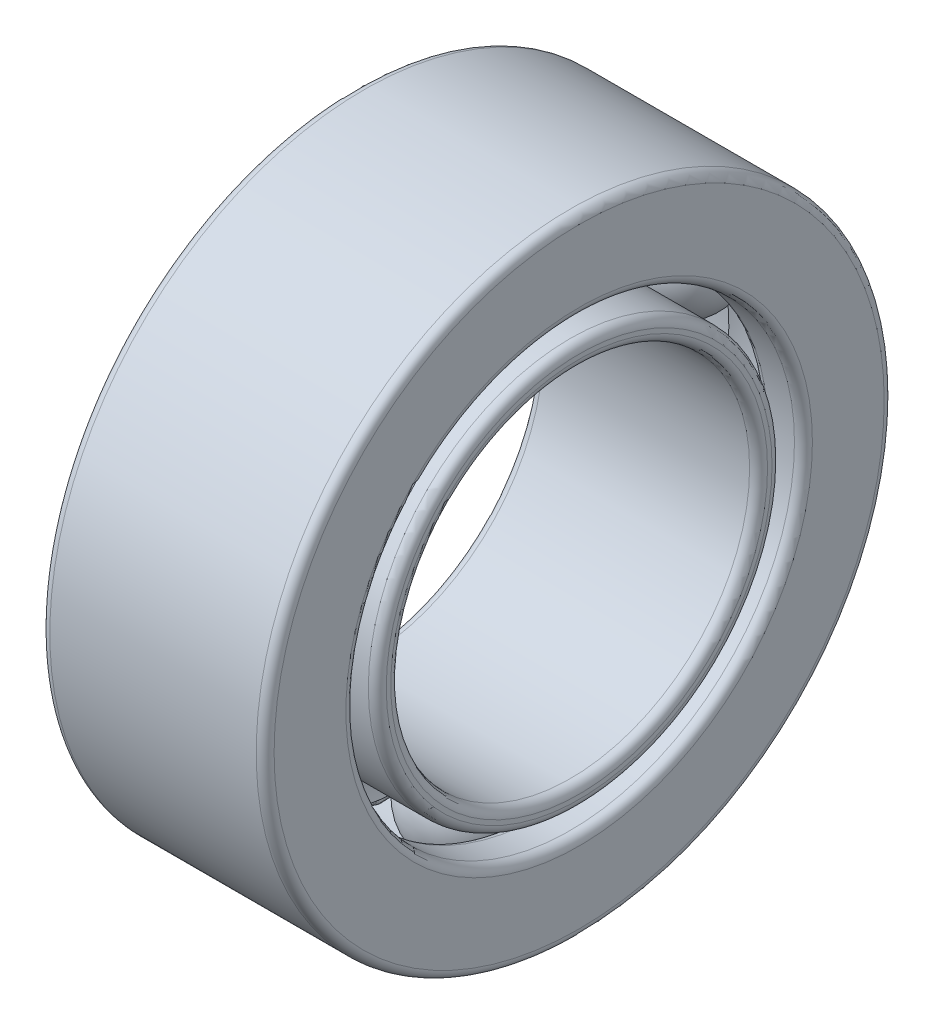
ISO-10303-21;
HEADER;
FILE_DESCRIPTION(('STEP AP214'),'2;1');
FILE_NAME('part.step','',(''),(''),'','','');
FILE_SCHEMA(('AUTOMOTIVE_DESIGN { 1 0 10303 214 1 1 1 1 }'));
ENDSEC;
DATA;
#1=APPLICATION_CONTEXT('core data for automotive mechanical design processes');
#2=APPLICATION_PROTOCOL_DEFINITION('international standard','automotive_design',2000,#1);
#3=PRODUCT_CONTEXT('',#1,'mechanical');
#4=PRODUCT('Part','Part','',(#3));
#5=PRODUCT_RELATED_PRODUCT_CATEGORY('part','',(#4));
#6=PRODUCT_DEFINITION_FORMATION('','',#4);
#7=PRODUCT_DEFINITION_CONTEXT('part definition',#1,'design');
#8=PRODUCT_DEFINITION('design','',#6,#7);
#9=PRODUCT_DEFINITION_SHAPE('','',#8);
#10=(LENGTH_UNIT() NAMED_UNIT(*) SI_UNIT(.MILLI.,.METRE.));
#11=(NAMED_UNIT(*) PLANE_ANGLE_UNIT() SI_UNIT($,.RADIAN.));
#12=(NAMED_UNIT(*) SI_UNIT($,.STERADIAN.) SOLID_ANGLE_UNIT());
#13=UNCERTAINTY_MEASURE_WITH_UNIT(LENGTH_MEASURE(1.E-05),#10,'distance_accuracy_value','');
#14=(GEOMETRIC_REPRESENTATION_CONTEXT(3) GLOBAL_UNCERTAINTY_ASSIGNED_CONTEXT((#13)) GLOBAL_UNIT_ASSIGNED_CONTEXT((#10,
#11,#12)) REPRESENTATION_CONTEXT('',''));
#15=CARTESIAN_POINT('',(0.,0.,0.));
#16=DIRECTION('',(0.,0.,1.));
#17=DIRECTION('',(1.,0.,0.));
#18=AXIS2_PLACEMENT_3D('',#15,#16,#17);
#19=CARTESIAN_POINT('',(0.,0.,0.));
#20=DIRECTION('',(1.,0.,0.));
#21=DIRECTION('',(0.,0.,-1.));
#22=AXIS2_PLACEMENT_3D('',#19,#20,#21);
#23=CYLINDRICAL_SURFACE('',#22,2.5);
#24=CARTESIAN_POINT('',(-0.670820393249937,0.,0.));
#25=DIRECTION('',(-1.,0.,0.));
#26=DIRECTION('',(0.,0.,1.));
#27=AXIS2_PLACEMENT_3D('',#24,#25,#26);
#28=CIRCLE('',#27,2.5);
#29=CARTESIAN_POINT('',(-0.670820393249937,0.,2.5));
#30=VERTEX_POINT('',#29);
#31=EDGE_CURVE('E58',#30,#30,#28,.F.);
#32=ORIENTED_EDGE('',*,*,#31,.T.);
#33=EDGE_LOOP('',(#32));
#34=FACE_BOUND('',#33,.T.);
#35=CARTESIAN_POINT('',(-1.1,0.,0.));
#36=DIRECTION('',(-1.,0.,0.));
#37=DIRECTION('',(0.,0.,1.));
#38=AXIS2_PLACEMENT_3D('',#35,#36,#37);
#39=CIRCLE('',#38,2.5);
#40=CARTESIAN_POINT('',(-1.1,0.,2.5));
#41=VERTEX_POINT('',#40);
#42=EDGE_CURVE('E62',#41,#41,#39,.T.);
#43=ORIENTED_EDGE('',*,*,#42,.T.);
#44=EDGE_LOOP('',(#43));
#45=FACE_BOUND('',#44,.T.);
#46=ADVANCED_FACE('F47',(#34,#45),#23,.F.);
#47=CARTESIAN_POINT('',(0.,0.,0.));
#48=DIRECTION('',(1.,0.,0.));
#49=DIRECTION('',(0.,0.,-1.));
#50=AXIS2_PLACEMENT_3D('',#47,#48,#49);
#51=TOROIDAL_SURFACE('',#50,2.75,0.65);
#52=CARTESIAN_POINT('',(-0.62290465087494,0.,0.));
#53=DIRECTION('',(1.,0.,0.));
#54=DIRECTION('',(0.,0.,-1.));
#55=AXIS2_PLACEMENT_3D('',#52,#53,#54);
#56=CIRCLE('',#55,2.93571428571429);
#57=CARTESIAN_POINT('',(-0.62290465087494,0.,-2.93571428571429));
#58=VERTEX_POINT('',#57);
#59=EDGE_CURVE('E73',#58,#58,#56,.T.);
#60=ORIENTED_EDGE('',*,*,#59,.T.);
#61=EDGE_LOOP('',(#60));
#62=FACE_BOUND('',#61,.T.);
#63=CARTESIAN_POINT('',(-0.622904650874951,0.,0.));
#64=DIRECTION('',(1.,0.,0.));
#65=DIRECTION('',(0.,0.,-1.));
#66=AXIS2_PLACEMENT_3D('',#63,#64,#65);
#67=CIRCLE('',#66,2.56428571428571);
#68=CARTESIAN_POINT('',(-0.622904650874951,0.,-2.56428571428571));
#69=VERTEX_POINT('',#68);
#70=EDGE_CURVE('E76',#69,#69,#67,.F.);
#71=ORIENTED_EDGE('',*,*,#70,.T.);
#72=EDGE_LOOP('',(#71));
#73=FACE_BOUND('',#72,.T.);
#74=ADVANCED_FACE('F80',(#62,#73),#51,.F.);
#75=CARTESIAN_POINT('',(0.,0.,0.));
#76=DIRECTION('',(1.,0.,0.));
#77=DIRECTION('',(0.,0.,-1.));
#78=AXIS2_PLACEMENT_3D('',#75,#76,#77);
#79=CYLINDRICAL_SURFACE('',#78,3.);
#80=CARTESIAN_POINT('',(-0.670820393249937,0.,0.));
#81=DIRECTION('',(-1.,0.,0.));
#82=DIRECTION('',(0.,0.,1.));
#83=AXIS2_PLACEMENT_3D('',#80,#81,#82);
#84=CIRCLE('',#83,3.);
#85=CARTESIAN_POINT('',(-0.670820393249937,0.,3.));
#86=VERTEX_POINT('',#85);
#87=EDGE_CURVE('E67',#86,#86,#84,.T.);
#88=ORIENTED_EDGE('',*,*,#87,.T.);
#89=EDGE_LOOP('',(#88));
#90=FACE_BOUND('',#89,.T.);
#91=CARTESIAN_POINT('',(-1.1,0.,0.));
#92=DIRECTION('',(-1.,0.,0.));
#93=DIRECTION('',(0.,0.,1.));
#94=AXIS2_PLACEMENT_3D('',#91,#92,#93);
#95=CIRCLE('',#94,3.);
#96=CARTESIAN_POINT('',(-1.1,0.,3.));
#97=VERTEX_POINT('',#96);
#98=EDGE_CURVE('E70',#97,#97,#95,.F.);
#99=ORIENTED_EDGE('',*,*,#98,.T.);
#100=EDGE_LOOP('',(#99));
#101=FACE_BOUND('',#100,.T.);
#102=ADVANCED_FACE('F108',(#90,#101),#79,.T.);
#103=CARTESIAN_POINT('',(-1.15,2.75,0.));
#104=DIRECTION('',(-1.,0.,0.));
#105=DIRECTION('',(0.,0.,1.));
#106=AXIS2_PLACEMENT_3D('',#103,#104,#105);
#107=PLANE('',#106);
#108=CARTESIAN_POINT('',(-1.15,0.,0.));
#109=DIRECTION('',(-1.,0.,0.));
#110=DIRECTION('',(0.,0.,1.));
#111=AXIS2_PLACEMENT_3D('',#108,#109,#110);
#112=CIRCLE('',#111,2.55);
#113=CARTESIAN_POINT('',(-1.15,0.,2.55));
#114=VERTEX_POINT('',#113);
#115=EDGE_CURVE('E12',#114,#114,#112,.F.);
#116=ORIENTED_EDGE('',*,*,#115,.T.);
#117=EDGE_LOOP('',(#116));
#118=FACE_BOUND('',#117,.T.);
#119=CARTESIAN_POINT('',(-1.15,0.,0.));
#120=DIRECTION('',(-1.,0.,0.));
#121=DIRECTION('',(0.,0.,1.));
#122=AXIS2_PLACEMENT_3D('',#119,#120,#121);
#123=CIRCLE('',#122,2.95);
#124=CARTESIAN_POINT('',(-1.15,0.,2.95));
#125=VERTEX_POINT('',#124);
#126=EDGE_CURVE('E54',#125,#125,#123,.T.);
#127=ORIENTED_EDGE('',*,*,#126,.T.);
#128=EDGE_LOOP('',(#127));
#129=FACE_BOUND('',#128,.T.);
#130=ADVANCED_FACE('F103',(#118,#129),#107,.T.);
#131=CARTESIAN_POINT('',(-0.670820393249937,0.,0.));
#132=DIRECTION('',(-1.,0.,0.));
#133=DIRECTION('',(0.,0.,1.));
#134=AXIS2_PLACEMENT_3D('',#131,#132,#133);
#135=TOROIDAL_SURFACE('',#134,2.95,0.05);
#136=ORIENTED_EDGE('',*,*,#87,.F.);
#137=EDGE_LOOP('',(#136));
#138=FACE_BOUND('',#137,.T.);
#139=ORIENTED_EDGE('',*,*,#59,.F.);
#140=EDGE_LOOP('',(#139));
#141=FACE_BOUND('',#140,.T.);
#142=ADVANCED_FACE('F86',(#138,#141),#135,.T.);
#143=CARTESIAN_POINT('',(-0.670820393249937,0.,0.));
#144=DIRECTION('',(-1.,0.,0.));
#145=DIRECTION('',(0.,0.,1.));
#146=AXIS2_PLACEMENT_3D('',#143,#144,#145);
#147=TOROIDAL_SURFACE('',#146,2.55,0.05);
#148=ORIENTED_EDGE('',*,*,#70,.F.);
#149=EDGE_LOOP('',(#148));
#150=FACE_BOUND('',#149,.T.);
#151=ORIENTED_EDGE('',*,*,#31,.F.);
#152=EDGE_LOOP('',(#151));
#153=FACE_BOUND('',#152,.T.);
#154=ADVANCED_FACE('F82',(#150,#153),#147,.T.);
#155=CARTESIAN_POINT('',(-1.1,0.,0.));
#156=DIRECTION('',(-1.,0.,0.));
#157=DIRECTION('',(0.,0.,1.));
#158=AXIS2_PLACEMENT_3D('',#155,#156,#157);
#159=TOROIDAL_SURFACE('',#158,2.55,0.05);
#160=ORIENTED_EDGE('',*,*,#42,.F.);
#161=EDGE_LOOP('',(#160));
#162=FACE_BOUND('',#161,.T.);
#163=ORIENTED_EDGE('',*,*,#115,.F.);
#164=EDGE_LOOP('',(#163));
#165=FACE_BOUND('',#164,.T.);
#166=ADVANCED_FACE('F85',(#162,#165),#159,.T.);
#167=CARTESIAN_POINT('',(-1.1,0.,0.));
#168=DIRECTION('',(-1.,0.,0.));
#169=DIRECTION('',(0.,0.,1.));
#170=AXIS2_PLACEMENT_3D('',#167,#168,#169);
#171=TOROIDAL_SURFACE('',#170,2.95,0.05);
#172=ORIENTED_EDGE('',*,*,#126,.F.);
#173=EDGE_LOOP('',(#172));
#174=FACE_BOUND('',#173,.T.);
#175=ORIENTED_EDGE('',*,*,#98,.F.);
#176=EDGE_LOOP('',(#175));
#177=FACE_BOUND('',#176,.T.);
#178=ADVANCED_FACE('F49',(#174,#177),#171,.T.);
#179=CLOSED_SHELL('',(#46,#74,#102,#130,#142,#154,#166,#178));
#180=MANIFOLD_SOLID_BREP('B2',#179);
#181=CARTESIAN_POINT('',(0.,-1.375,-2.3815698604072));
#182=DIRECTION('',(0.,-0.500000000000001,-0.866025403784438));
#183=DIRECTION('',(0.,-0.866025403784438,0.500000000000001));
#184=AXIS2_PLACEMENT_3D('',#181,#182,#183);
#185=SPHERICAL_SURFACE('',#184,0.6);
#186=CARTESIAN_POINT('',(0.,-1.675,-2.90118510267787));
#187=VERTEX_POINT('',#186);
#188=VERTEX_LOOP('',#187);
#189=FACE_BOUND('',#188,.T.);
#190=ADVANCED_FACE('F185',(#189),#185,.T.);
#191=CLOSED_SHELL('',(#190));
#192=MANIFOLD_SOLID_BREP('B7',#191);
#193=CARTESIAN_POINT('',(0.,1.375,2.3815698604072));
#194=DIRECTION('',(0.,-0.500000000000001,-0.866025403784438));
#195=DIRECTION('',(0.,0.866025403784438,-0.500000000000001));
#196=AXIS2_PLACEMENT_3D('',#193,#194,#195);
#197=SPHERICAL_SURFACE('',#196,0.6);
#198=CARTESIAN_POINT('',(0.,1.075,1.86195461813654));
#199=VERTEX_POINT('',#198);
#200=VERTEX_LOOP('',#199);
#201=FACE_BOUND('',#200,.T.);
#202=ADVANCED_FACE('F205',(#201),#197,.T.);
#203=CLOSED_SHELL('',(#202));
#204=MANIFOLD_SOLID_BREP('B43',#203);
#205=CARTESIAN_POINT('',(0.,-1.375,2.3815698604072));
#206=DIRECTION('',(0.,0.500000000000001,-0.866025403784438));
#207=DIRECTION('',(0.,0.866025403784438,0.500000000000001));
#208=AXIS2_PLACEMENT_3D('',#205,#206,#207);
#209=SPHERICAL_SURFACE('',#208,0.6);
#210=CARTESIAN_POINT('',(0.,-1.075,1.86195461813654));
#211=VERTEX_POINT('',#210);
#212=VERTEX_LOOP('',#211);
#213=FACE_BOUND('',#212,.T.);
#214=ADVANCED_FACE('F225',(#213),#209,.T.);
#215=CLOSED_SHELL('',(#214));
#216=MANIFOLD_SOLID_BREP('B181',#215);
#217=CARTESIAN_POINT('',(0.,1.375,-2.3815698604072));
#218=DIRECTION('',(0.,0.500000000000001,-0.866025403784438));
#219=DIRECTION('',(0.,-0.866025403784438,-0.500000000000001));
#220=AXIS2_PLACEMENT_3D('',#217,#218,#219);
#221=SPHERICAL_SURFACE('',#220,0.6);
#222=CARTESIAN_POINT('',(0.,1.675,-2.90118510267787));
#223=VERTEX_POINT('',#222);
#224=VERTEX_LOOP('',#223);
#225=FACE_BOUND('',#224,.T.);
#226=ADVANCED_FACE('F245',(#225),#221,.T.);
#227=CLOSED_SHELL('',(#226));
#228=MANIFOLD_SOLID_BREP('B201',#227);
#229=CARTESIAN_POINT('',(0.,-2.74999999999985,0.));
#230=DIRECTION('',(0.,-1.,0.));
#231=DIRECTION('',(0.,0.,1.));
#232=AXIS2_PLACEMENT_3D('',#229,#230,#231);
#233=SPHERICAL_SURFACE('',#232,0.6);
#234=CARTESIAN_POINT('',(0.,-3.34999999999985,0.));
#235=VERTEX_POINT('',#234);
#236=VERTEX_LOOP('',#235);
#237=FACE_BOUND('',#236,.T.);
#238=ADVANCED_FACE('F265',(#237),#233,.T.);
#239=CLOSED_SHELL('',(#238));
#240=MANIFOLD_SOLID_BREP('B221',#239);
#241=CARTESIAN_POINT('',(0.,2.75,0.));
#242=DIRECTION('',(0.,-1.,0.));
#243=DIRECTION('',(0.,0.,1.));
#244=AXIS2_PLACEMENT_3D('',#241,#242,#243);
#245=SPHERICAL_SURFACE('',#244,0.6);
#246=CARTESIAN_POINT('',(0.,2.15,0.));
#247=VERTEX_POINT('',#246);
#248=VERTEX_LOOP('',#247);
#249=FACE_BOUND('',#248,.T.);
#250=ADVANCED_FACE('F287',(#249),#245,.T.);
#251=CLOSED_SHELL('',(#250));
#252=MANIFOLD_SOLID_BREP('B241',#251);
#253=CARTESIAN_POINT('',(1.25,0.,0.));
#254=DIRECTION('',(-1.,0.,0.));
#255=DIRECTION('',(0.,0.,1.));
#256=AXIS2_PLACEMENT_3D('',#253,#254,#255);
#257=CYLINDRICAL_SURFACE('',#256,2.25);
#258=CARTESIAN_POINT('',(-1.15,0.,0.));
#259=DIRECTION('',(1.,0.,0.));
#260=DIRECTION('',(0.,0.,-1.));
#261=AXIS2_PLACEMENT_3D('',#258,#259,#260);
#262=CIRCLE('',#261,2.25);
#263=CARTESIAN_POINT('',(-1.15,0.,-2.25));
#264=VERTEX_POINT('',#263);
#265=EDGE_CURVE('E286',#264,#264,#262,.T.);
#266=ORIENTED_EDGE('',*,*,#265,.T.);
#267=EDGE_LOOP('',(#266));
#268=FACE_BOUND('',#267,.T.);
#269=CARTESIAN_POINT('',(-0.33166247903554,0.,0.));
#270=DIRECTION('',(-1.,0.,0.));
#271=DIRECTION('',(0.,0.,1.));
#272=AXIS2_PLACEMENT_3D('',#269,#270,#271);
#273=CIRCLE('',#272,2.25);
#274=CARTESIAN_POINT('',(-0.33166247903554,0.,2.25));
#275=VERTEX_POINT('',#274);
#276=EDGE_CURVE('E343',#275,#275,#273,.T.);
#277=ORIENTED_EDGE('',*,*,#276,.T.);
#278=EDGE_LOOP('',(#277));
#279=FACE_BOUND('',#278,.T.);
#280=ADVANCED_FACE('F308',(#268,#279),#257,.T.);
#281=CARTESIAN_POINT('',(1.15,0.,0.));
#282=DIRECTION('',(1.,0.,0.));
#283=DIRECTION('',(0.,0.,-1.));
#284=AXIS2_PLACEMENT_3D('',#281,#282,#283);
#285=CIRCLE('',#284,2.25);
#286=CARTESIAN_POINT('',(1.15,0.,-2.25));
#287=VERTEX_POINT('',#286);
#288=EDGE_CURVE('E323',#287,#287,#285,.F.);
#289=ORIENTED_EDGE('',*,*,#288,.T.);
#290=EDGE_LOOP('',(#289));
#291=FACE_BOUND('',#290,.T.);
#292=CARTESIAN_POINT('',(0.33166247903554,0.,0.));
#293=DIRECTION('',(-1.,0.,0.));
#294=DIRECTION('',(0.,0.,1.));
#295=AXIS2_PLACEMENT_3D('',#292,#293,#294);
#296=CIRCLE('',#295,2.25);
#297=CARTESIAN_POINT('',(0.33166247903554,0.,2.25));
#298=VERTEX_POINT('',#297);
#299=EDGE_CURVE('E340',#298,#298,#296,.T.);
#300=ORIENTED_EDGE('',*,*,#299,.F.);
#301=EDGE_LOOP('',(#300));
#302=FACE_BOUND('',#301,.T.);
#303=ADVANCED_FACE('F356',(#291,#302),#257,.T.);
#304=CARTESIAN_POINT('',(1.25,0.,0.));
#305=DIRECTION('',(-1.,0.,0.));
#306=DIRECTION('',(0.,0.,1.));
#307=AXIS2_PLACEMENT_3D('',#304,#305,#306);
#308=CYLINDRICAL_SURFACE('',#307,2.);
#309=CARTESIAN_POINT('',(1.15,0.,0.));
#310=DIRECTION('',(1.,0.,0.));
#311=DIRECTION('',(0.,0.,-1.));
#312=AXIS2_PLACEMENT_3D('',#309,#310,#311);
#313=CIRCLE('',#312,2.);
#314=CARTESIAN_POINT('',(1.15,0.,-2.));
#315=VERTEX_POINT('',#314);
#316=EDGE_CURVE('E334',#315,#315,#313,.T.);
#317=ORIENTED_EDGE('',*,*,#316,.T.);
#318=EDGE_LOOP('',(#317));
#319=FACE_BOUND('',#318,.T.);
#320=CARTESIAN_POINT('',(-1.15,0.,0.));
#321=DIRECTION('',(1.,0.,0.));
#322=DIRECTION('',(0.,0.,-1.));
#323=AXIS2_PLACEMENT_3D('',#320,#321,#322);
#324=CIRCLE('',#323,2.);
#325=CARTESIAN_POINT('',(-1.15,0.,-2.));
#326=VERTEX_POINT('',#325);
#327=EDGE_CURVE('E337',#326,#326,#324,.F.);
#328=ORIENTED_EDGE('',*,*,#327,.T.);
#329=EDGE_LOOP('',(#328));
#330=FACE_BOUND('',#329,.T.);
#331=ADVANCED_FACE('F358',(#319,#330),#308,.F.);
#332=CARTESIAN_POINT('',(1.25,0.,0.));
#333=DIRECTION('',(1.,0.,0.));
#334=DIRECTION('',(0.,0.,-1.));
#335=AXIS2_PLACEMENT_3D('',#332,#333,#334);
#336=PLANE('',#335);
#337=CARTESIAN_POINT('',(1.25,0.,0.));
#338=DIRECTION('',(1.,0.,0.));
#339=DIRECTION('',(0.,0.,-1.));
#340=AXIS2_PLACEMENT_3D('',#337,#338,#339);
#341=CIRCLE('',#340,2.1);
#342=CARTESIAN_POINT('',(1.25,0.,-2.1));
#343=VERTEX_POINT('',#342);
#344=EDGE_CURVE('E328',#343,#343,#341,.F.);
#345=ORIENTED_EDGE('',*,*,#344,.T.);
#346=EDGE_LOOP('',(#345));
#347=FACE_BOUND('',#346,.T.);
#348=CARTESIAN_POINT('',(1.25,0.,0.));
#349=DIRECTION('',(1.,0.,0.));
#350=DIRECTION('',(0.,0.,-1.));
#351=AXIS2_PLACEMENT_3D('',#348,#349,#350);
#352=CIRCLE('',#351,2.15);
#353=CARTESIAN_POINT('',(1.25,0.,-2.15));
#354=VERTEX_POINT('',#353);
#355=EDGE_CURVE('E331',#354,#354,#352,.T.);
#356=ORIENTED_EDGE('',*,*,#355,.T.);
#357=EDGE_LOOP('',(#356));
#358=FACE_BOUND('',#357,.T.);
#359=ADVANCED_FACE('F365',(#347,#358),#336,.T.);
#360=CARTESIAN_POINT('',(-1.25,0.,0.));
#361=DIRECTION('',(1.,0.,0.));
#362=DIRECTION('',(0.,0.,-1.));
#363=AXIS2_PLACEMENT_3D('',#360,#361,#362);
#364=PLANE('',#363);
#365=CARTESIAN_POINT('',(-1.25,0.,0.));
#366=DIRECTION('',(1.,0.,0.));
#367=DIRECTION('',(0.,0.,-1.));
#368=AXIS2_PLACEMENT_3D('',#365,#366,#367);
#369=CIRCLE('',#368,2.1);
#370=CARTESIAN_POINT('',(-1.25,0.,-2.1));
#371=VERTEX_POINT('',#370);
#372=EDGE_CURVE('E315',#371,#371,#369,.T.);
#373=ORIENTED_EDGE('',*,*,#372,.T.);
#374=EDGE_LOOP('',(#373));
#375=FACE_BOUND('',#374,.T.);
#376=CARTESIAN_POINT('',(-1.25,0.,0.));
#377=DIRECTION('',(1.,0.,0.));
#378=DIRECTION('',(0.,0.,-1.));
#379=AXIS2_PLACEMENT_3D('',#376,#377,#378);
#380=CIRCLE('',#379,2.15);
#381=CARTESIAN_POINT('',(-1.25,0.,-2.15));
#382=VERTEX_POINT('',#381);
#383=EDGE_CURVE('E319',#382,#382,#380,.F.);
#384=ORIENTED_EDGE('',*,*,#383,.T.);
#385=EDGE_LOOP('',(#384));
#386=FACE_BOUND('',#385,.T.);
#387=ADVANCED_FACE('F352',(#375,#386),#364,.F.);
#388=CARTESIAN_POINT('',(0.,0.,0.));
#389=DIRECTION('',(-1.,0.,0.));
#390=DIRECTION('',(0.,0.,1.));
#391=AXIS2_PLACEMENT_3D('',#388,#389,#390);
#392=TOROIDAL_SURFACE('',#391,2.75,0.6);
#393=ORIENTED_EDGE('',*,*,#276,.F.);
#394=EDGE_LOOP('',(#393));
#395=FACE_BOUND('',#394,.T.);
#396=ORIENTED_EDGE('',*,*,#299,.T.);
#397=EDGE_LOOP('',(#396));
#398=FACE_BOUND('',#397,.T.);
#399=ADVANCED_FACE('F348',(#395,#398),#392,.F.);
#400=CARTESIAN_POINT('',(1.15,0.,0.));
#401=DIRECTION('',(1.,0.,0.));
#402=DIRECTION('',(0.,0.,-1.));
#403=AXIS2_PLACEMENT_3D('',#400,#401,#402);
#404=TOROIDAL_SURFACE('',#403,2.1,0.1);
#405=ORIENTED_EDGE('',*,*,#344,.F.);
#406=EDGE_LOOP('',(#405));
#407=FACE_BOUND('',#406,.T.);
#408=ORIENTED_EDGE('',*,*,#316,.F.);
#409=EDGE_LOOP('',(#408));
#410=FACE_BOUND('',#409,.T.);
#411=ADVANCED_FACE('F351',(#407,#410),#404,.T.);
#412=CARTESIAN_POINT('',(1.15,0.,0.));
#413=DIRECTION('',(1.,0.,0.));
#414=DIRECTION('',(0.,0.,-1.));
#415=AXIS2_PLACEMENT_3D('',#412,#413,#414);
#416=TOROIDAL_SURFACE('',#415,2.15,0.1);
#417=ORIENTED_EDGE('',*,*,#288,.F.);
#418=EDGE_LOOP('',(#417));
#419=FACE_BOUND('',#418,.T.);
#420=ORIENTED_EDGE('',*,*,#355,.F.);
#421=EDGE_LOOP('',(#420));
#422=FACE_BOUND('',#421,.T.);
#423=ADVANCED_FACE('F373',(#419,#422),#416,.T.);
#424=CARTESIAN_POINT('',(-1.15,0.,0.));
#425=DIRECTION('',(1.,0.,0.));
#426=DIRECTION('',(0.,0.,-1.));
#427=AXIS2_PLACEMENT_3D('',#424,#425,#426);
#428=TOROIDAL_SURFACE('',#427,2.1,0.1);
#429=ORIENTED_EDGE('',*,*,#327,.F.);
#430=EDGE_LOOP('',(#429));
#431=FACE_BOUND('',#430,.T.);
#432=ORIENTED_EDGE('',*,*,#372,.F.);
#433=EDGE_LOOP('',(#432));
#434=FACE_BOUND('',#433,.T.);
#435=ADVANCED_FACE('F376',(#431,#434),#428,.T.);
#436=CARTESIAN_POINT('',(-1.15,0.,0.));
#437=DIRECTION('',(1.,0.,0.));
#438=DIRECTION('',(0.,0.,-1.));
#439=AXIS2_PLACEMENT_3D('',#436,#437,#438);
#440=TOROIDAL_SURFACE('',#439,2.15,0.1);
#441=ORIENTED_EDGE('',*,*,#383,.F.);
#442=EDGE_LOOP('',(#441));
#443=FACE_BOUND('',#442,.T.);
#444=ORIENTED_EDGE('',*,*,#265,.F.);
#445=EDGE_LOOP('',(#444));
#446=FACE_BOUND('',#445,.T.);
#447=ADVANCED_FACE('F310',(#443,#446),#440,.T.);
#448=CLOSED_SHELL('',(#280,#303,#331,#359,#387,#399,#411,#423,#435,#447));
#449=MANIFOLD_SOLID_BREP('B261',#448);
#450=CARTESIAN_POINT('',(1.25,0.,0.));
#451=DIRECTION('',(-1.,0.,0.));
#452=DIRECTION('',(0.,0.,1.));
#453=AXIS2_PLACEMENT_3D('',#450,#451,#452);
#454=CYLINDRICAL_SURFACE('',#453,3.25);
#455=CARTESIAN_POINT('',(0.65,0.,0.));
#456=DIRECTION('',(1.,0.,0.));
#457=DIRECTION('',(0.,0.,-1.));
#458=AXIS2_PLACEMENT_3D('',#455,#456,#457);
#459=CIRCLE('',#458,3.25);
#460=CARTESIAN_POINT('',(0.65,0.,-3.25));
#461=VERTEX_POINT('',#460);
#462=EDGE_CURVE('E469',#461,#461,#459,.T.);
#463=ORIENTED_EDGE('',*,*,#462,.T.);
#464=EDGE_LOOP('',(#463));
#465=FACE_BOUND('',#464,.T.);
#466=CARTESIAN_POINT('',(0.331662479035539,0.,0.));
#467=DIRECTION('',(-1.,0.,0.));
#468=DIRECTION('',(0.,0.,1.));
#469=AXIS2_PLACEMENT_3D('',#466,#467,#468);
#470=CIRCLE('',#469,3.25);
#471=CARTESIAN_POINT('',(0.331662479035539,0.,3.25));
#472=VERTEX_POINT('',#471);
#473=EDGE_CURVE('E505',#472,#472,#470,.T.);
#474=ORIENTED_EDGE('',*,*,#473,.T.);
#475=EDGE_LOOP('',(#474));
#476=FACE_BOUND('',#475,.T.);
#477=ADVANCED_FACE('F458',(#465,#476),#454,.F.);
#478=CARTESIAN_POINT('',(-1.15,0.,0.));
#479=DIRECTION('',(1.,0.,0.));
#480=DIRECTION('',(0.,0.,-1.));
#481=AXIS2_PLACEMENT_3D('',#478,#479,#480);
#482=CIRCLE('',#481,3.25);
#483=CARTESIAN_POINT('',(-1.15,0.,-3.25));
#484=VERTEX_POINT('',#483);
#485=EDGE_CURVE('E473',#484,#484,#482,.F.);
#486=ORIENTED_EDGE('',*,*,#485,.T.);
#487=EDGE_LOOP('',(#486));
#488=FACE_BOUND('',#487,.T.);
#489=CARTESIAN_POINT('',(-0.331662479035539,0.,0.));
#490=DIRECTION('',(-1.,0.,0.));
#491=DIRECTION('',(0.,0.,1.));
#492=AXIS2_PLACEMENT_3D('',#489,#490,#491);
#493=CIRCLE('',#492,3.25);
#494=CARTESIAN_POINT('',(-0.331662479035539,0.,3.25));
#495=VERTEX_POINT('',#494);
#496=EDGE_CURVE('E502',#495,#495,#493,.T.);
#497=ORIENTED_EDGE('',*,*,#496,.F.);
#498=EDGE_LOOP('',(#497));
#499=FACE_BOUND('',#498,.T.);
#500=ADVANCED_FACE('F528',(#488,#499),#454,.F.);
#501=CARTESIAN_POINT('',(1.25,0.,0.));
#502=DIRECTION('',(-1.,0.,0.));
#503=DIRECTION('',(0.,0.,1.));
#504=AXIS2_PLACEMENT_3D('',#501,#502,#503);
#505=CYLINDRICAL_SURFACE('',#504,3.5);
#506=CARTESIAN_POINT('',(-1.15,0.,0.));
#507=DIRECTION('',(1.,0.,0.));
#508=DIRECTION('',(0.,0.,-1.));
#509=AXIS2_PLACEMENT_3D('',#506,#507,#508);
#510=CIRCLE('',#509,3.5);
#511=CARTESIAN_POINT('',(-1.15,0.,-3.5));
#512=VERTEX_POINT('',#511);
#513=EDGE_CURVE('E307',#512,#512,#510,.T.);
#514=ORIENTED_EDGE('',*,*,#513,.T.);
#515=EDGE_LOOP('',(#514));
#516=FACE_BOUND('',#515,.T.);
#517=CARTESIAN_POINT('',(1.15,0.,0.));
#518=DIRECTION('',(1.,0.,0.));
#519=DIRECTION('',(0.,0.,-1.));
#520=AXIS2_PLACEMENT_3D('',#517,#518,#519);
#521=CIRCLE('',#520,3.5);
#522=CARTESIAN_POINT('',(1.15,0.,-3.5));
#523=VERTEX_POINT('',#522);
#524=EDGE_CURVE('E465',#523,#523,#521,.F.);
#525=ORIENTED_EDGE('',*,*,#524,.T.);
#526=EDGE_LOOP('',(#525));
#527=FACE_BOUND('',#526,.T.);
#528=ADVANCED_FACE('F534',(#516,#527),#505,.T.);
#529=CARTESIAN_POINT('',(1.25,0.,0.));
#530=DIRECTION('',(1.,0.,0.));
#531=DIRECTION('',(0.,0.,-1.));
#532=AXIS2_PLACEMENT_3D('',#529,#530,#531);
#533=PLANE('',#532);
#534=CARTESIAN_POINT('',(1.25,0.,0.));
#535=DIRECTION('',(1.,0.,0.));
#536=DIRECTION('',(0.,0.,-1.));
#537=AXIS2_PLACEMENT_3D('',#534,#535,#536);
#538=CIRCLE('',#537,2.6);
#539=CARTESIAN_POINT('',(1.25,0.,-2.6));
#540=VERTEX_POINT('',#539);
#541=EDGE_CURVE('E496',#540,#540,#538,.F.);
#542=ORIENTED_EDGE('',*,*,#541,.T.);
#543=EDGE_LOOP('',(#542));
#544=FACE_BOUND('',#543,.T.);
#545=CARTESIAN_POINT('',(1.25,0.,0.));
#546=DIRECTION('',(1.,0.,0.));
#547=DIRECTION('',(0.,0.,-1.));
#548=AXIS2_PLACEMENT_3D('',#545,#546,#547);
#549=CIRCLE('',#548,3.4);
#550=CARTESIAN_POINT('',(1.25,0.,-3.4));
#551=VERTEX_POINT('',#550);
#552=EDGE_CURVE('E499',#551,#551,#549,.T.);
#553=ORIENTED_EDGE('',*,*,#552,.T.);
#554=EDGE_LOOP('',(#553));
#555=FACE_BOUND('',#554,.T.);
#556=ADVANCED_FACE('F523',(#544,#555),#533,.T.);
#557=CARTESIAN_POINT('',(-1.25,0.,0.));
#558=DIRECTION('',(1.,0.,0.));
#559=DIRECTION('',(0.,0.,-1.));
#560=AXIS2_PLACEMENT_3D('',#557,#558,#559);
#561=PLANE('',#560);
#562=CARTESIAN_POINT('',(-1.25,0.,0.));
#563=DIRECTION('',(1.,0.,0.));
#564=DIRECTION('',(0.,0.,-1.));
#565=AXIS2_PLACEMENT_3D('',#562,#563,#564);
#566=CIRCLE('',#565,3.35);
#567=CARTESIAN_POINT('',(-1.25,0.,-3.35));
#568=VERTEX_POINT('',#567);
#569=EDGE_CURVE('E478',#568,#568,#566,.T.);
#570=ORIENTED_EDGE('',*,*,#569,.T.);
#571=EDGE_LOOP('',(#570));
#572=FACE_BOUND('',#571,.T.);
#573=CARTESIAN_POINT('',(-1.25,0.,0.));
#574=DIRECTION('',(1.,0.,0.));
#575=DIRECTION('',(0.,0.,-1.));
#576=AXIS2_PLACEMENT_3D('',#573,#574,#575);
#577=CIRCLE('',#576,3.4);
#578=CARTESIAN_POINT('',(-1.25,0.,-3.4));
#579=VERTEX_POINT('',#578);
#580=EDGE_CURVE('E481',#579,#579,#577,.F.);
#581=ORIENTED_EDGE('',*,*,#580,.T.);
#582=EDGE_LOOP('',(#581));
#583=FACE_BOUND('',#582,.T.);
#584=ADVANCED_FACE('F513',(#572,#583),#561,.F.);
#585=CARTESIAN_POINT('',(0.,0.,0.));
#586=DIRECTION('',(-1.,0.,0.));
#587=DIRECTION('',(0.,0.,1.));
#588=AXIS2_PLACEMENT_3D('',#585,#586,#587);
#589=TOROIDAL_SURFACE('',#588,2.75,0.6);
#590=ORIENTED_EDGE('',*,*,#496,.T.);
#591=EDGE_LOOP('',(#590));
#592=FACE_BOUND('',#591,.T.);
#593=ORIENTED_EDGE('',*,*,#473,.F.);
#594=EDGE_LOOP('',(#593));
#595=FACE_BOUND('',#594,.T.);
#596=ADVANCED_FACE('F510',(#592,#595),#589,.F.);
#597=CARTESIAN_POINT('',(0.,0.,0.));
#598=DIRECTION('',(-1.,0.,0.));
#599=DIRECTION('',(0.,0.,1.));
#600=AXIS2_PLACEMENT_3D('',#597,#598,#599);
#601=CYLINDRICAL_SURFACE('',#600,2.5);
#602=CARTESIAN_POINT('',(1.15,0.,0.));
#603=DIRECTION('',(1.,0.,0.));
#604=DIRECTION('',(0.,0.,-1.));
#605=AXIS2_PLACEMENT_3D('',#602,#603,#604);
#606=CIRCLE('',#605,2.5);
#607=CARTESIAN_POINT('',(1.15,0.,-2.5));
#608=VERTEX_POINT('',#607);
#609=EDGE_CURVE('E490',#608,#608,#606,.T.);
#610=ORIENTED_EDGE('',*,*,#609,.T.);
#611=EDGE_LOOP('',(#610));
#612=FACE_BOUND('',#611,.T.);
#613=CARTESIAN_POINT('',(0.85,0.,0.));
#614=DIRECTION('',(1.,0.,0.));
#615=DIRECTION('',(0.,0.,-1.));
#616=AXIS2_PLACEMENT_3D('',#613,#614,#615);
#617=CIRCLE('',#616,2.5);
#618=CARTESIAN_POINT('',(0.85,0.,-2.5));
#619=VERTEX_POINT('',#618);
#620=EDGE_CURVE('E493',#619,#619,#617,.F.);
#621=ORIENTED_EDGE('',*,*,#620,.T.);
#622=EDGE_LOOP('',(#621));
#623=FACE_BOUND('',#622,.T.);
#624=ADVANCED_FACE('F512',(#612,#623),#601,.F.);
#625=CARTESIAN_POINT('',(0.75,3.5,0.));
#626=DIRECTION('',(1.,0.,0.));
#627=DIRECTION('',(0.,0.,-1.));
#628=AXIS2_PLACEMENT_3D('',#625,#626,#627);
#629=PLANE('',#628);
#630=CARTESIAN_POINT('',(0.75,0.,0.));
#631=DIRECTION('',(1.,0.,0.));
#632=DIRECTION('',(0.,0.,-1.));
#633=AXIS2_PLACEMENT_3D('',#630,#631,#632);
#634=CIRCLE('',#633,2.6);
#635=CARTESIAN_POINT('',(0.75,0.,-2.6));
#636=VERTEX_POINT('',#635);
#637=EDGE_CURVE('E484',#636,#636,#634,.T.);
#638=ORIENTED_EDGE('',*,*,#637,.T.);
#639=EDGE_LOOP('',(#638));
#640=FACE_BOUND('',#639,.T.);
#641=CARTESIAN_POINT('',(0.75,0.,0.));
#642=DIRECTION('',(1.,0.,0.));
#643=DIRECTION('',(0.,0.,-1.));
#644=AXIS2_PLACEMENT_3D('',#641,#642,#643);
#645=CIRCLE('',#644,3.15);
#646=CARTESIAN_POINT('',(0.75,0.,-3.15));
#647=VERTEX_POINT('',#646);
#648=EDGE_CURVE('E487',#647,#647,#645,.F.);
#649=ORIENTED_EDGE('',*,*,#648,.T.);
#650=EDGE_LOOP('',(#649));
#651=FACE_BOUND('',#650,.T.);
#652=ADVANCED_FACE('F520',(#640,#651),#629,.F.);
#653=CARTESIAN_POINT('',(1.15,0.,0.));
#654=DIRECTION('',(1.,0.,0.));
#655=DIRECTION('',(0.,0.,-1.));
#656=AXIS2_PLACEMENT_3D('',#653,#654,#655);
#657=TOROIDAL_SURFACE('',#656,2.6,0.1);
#658=ORIENTED_EDGE('',*,*,#609,.F.);
#659=EDGE_LOOP('',(#658));
#660=FACE_BOUND('',#659,.T.);
#661=ORIENTED_EDGE('',*,*,#541,.F.);
#662=EDGE_LOOP('',(#661));
#663=FACE_BOUND('',#662,.T.);
#664=ADVANCED_FACE('F538',(#660,#663),#657,.T.);
#665=CARTESIAN_POINT('',(0.85,0.,0.));
#666=DIRECTION('',(1.,0.,0.));
#667=DIRECTION('',(0.,0.,-1.));
#668=AXIS2_PLACEMENT_3D('',#665,#666,#667);
#669=TOROIDAL_SURFACE('',#668,2.6,0.1);
#670=ORIENTED_EDGE('',*,*,#637,.F.);
#671=EDGE_LOOP('',(#670));
#672=FACE_BOUND('',#671,.T.);
#673=ORIENTED_EDGE('',*,*,#620,.F.);
#674=EDGE_LOOP('',(#673));
#675=FACE_BOUND('',#674,.T.);
#676=ADVANCED_FACE('F541',(#672,#675),#669,.T.);
#677=CARTESIAN_POINT('',(-1.15,0.,0.));
#678=DIRECTION('',(1.,0.,0.));
#679=DIRECTION('',(0.,0.,-1.));
#680=AXIS2_PLACEMENT_3D('',#677,#678,#679);
#681=TOROIDAL_SURFACE('',#680,3.35,0.1);
#682=ORIENTED_EDGE('',*,*,#485,.F.);
#683=EDGE_LOOP('',(#682));
#684=FACE_BOUND('',#683,.T.);
#685=ORIENTED_EDGE('',*,*,#569,.F.);
#686=EDGE_LOOP('',(#685));
#687=FACE_BOUND('',#686,.T.);
#688=ADVANCED_FACE('F545',(#684,#687),#681,.T.);
#689=CARTESIAN_POINT('',(0.65,0.,0.));
#690=DIRECTION('',(1.,0.,0.));
#691=DIRECTION('',(0.,0.,-1.));
#692=AXIS2_PLACEMENT_3D('',#689,#690,#691);
#693=TOROIDAL_SURFACE('',#692,3.15,0.1);
#694=ORIENTED_EDGE('',*,*,#648,.F.);
#695=EDGE_LOOP('',(#694));
#696=FACE_BOUND('',#695,.T.);
#697=ORIENTED_EDGE('',*,*,#462,.F.);
#698=EDGE_LOOP('',(#697));
#699=FACE_BOUND('',#698,.T.);
#700=ADVANCED_FACE('F549',(#696,#699),#693,.F.);
#701=CARTESIAN_POINT('',(-1.15,0.,0.));
#702=DIRECTION('',(1.,0.,0.));
#703=DIRECTION('',(0.,0.,-1.));
#704=AXIS2_PLACEMENT_3D('',#701,#702,#703);
#705=TOROIDAL_SURFACE('',#704,3.4,0.1);
#706=ORIENTED_EDGE('',*,*,#580,.F.);
#707=EDGE_LOOP('',(#706));
#708=FACE_BOUND('',#707,.T.);
#709=ORIENTED_EDGE('',*,*,#513,.F.);
#710=EDGE_LOOP('',(#709));
#711=FACE_BOUND('',#710,.T.);
#712=ADVANCED_FACE('F552',(#708,#711),#705,.T.);
#713=CARTESIAN_POINT('',(1.15,0.,0.));
#714=DIRECTION('',(1.,0.,0.));
#715=DIRECTION('',(0.,0.,-1.));
#716=AXIS2_PLACEMENT_3D('',#713,#714,#715);
#717=TOROIDAL_SURFACE('',#716,3.4,0.1);
#718=ORIENTED_EDGE('',*,*,#524,.F.);
#719=EDGE_LOOP('',(#718));
#720=FACE_BOUND('',#719,.T.);
#721=ORIENTED_EDGE('',*,*,#552,.F.);
#722=EDGE_LOOP('',(#721));
#723=FACE_BOUND('',#722,.T.);
#724=ADVANCED_FACE('F460',(#720,#723),#717,.T.);
#725=CLOSED_SHELL('',(#477,#500,#528,#556,#584,#596,#624,#652,#664,#676,#688,#700,#712,#724));
#726=MANIFOLD_SOLID_BREP('B281',#725);
#727=ADVANCED_BREP_SHAPE_REPRESENTATION('',(#18,#180,#192,#204,#216,#228,#240,#252,#449,#726),#14);
#728=SHAPE_DEFINITION_REPRESENTATION(#9,#727);
ENDSEC;
END-ISO-10303-21;
